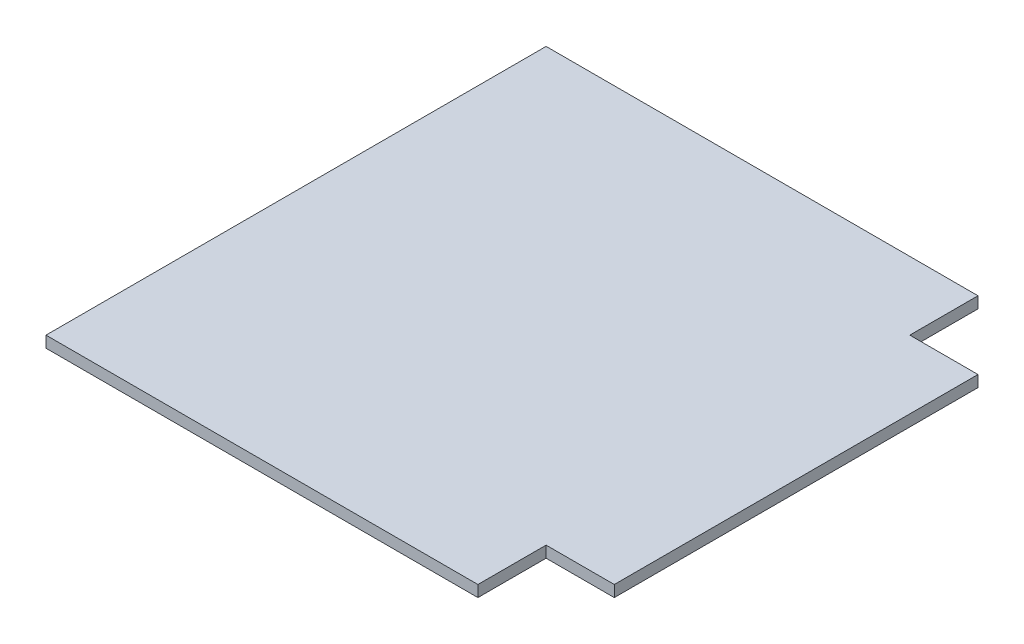
ISO-10303-21;
HEADER;
FILE_DESCRIPTION(('STEP AP214'),'2;1');
FILE_NAME('part.step','',(''),(''),'','','');
FILE_SCHEMA(('AUTOMOTIVE_DESIGN { 1 0 10303 214 1 1 1 1 }'));
ENDSEC;
DATA;
#1=APPLICATION_CONTEXT('core data for automotive mechanical design processes');
#2=APPLICATION_PROTOCOL_DEFINITION('international standard','automotive_design',2000,#1);
#3=PRODUCT_CONTEXT('',#1,'mechanical');
#4=PRODUCT('Part','Part','',(#3));
#5=PRODUCT_RELATED_PRODUCT_CATEGORY('part','',(#4));
#6=PRODUCT_DEFINITION_FORMATION('','',#4);
#7=PRODUCT_DEFINITION_CONTEXT('part definition',#1,'design');
#8=PRODUCT_DEFINITION('design','',#6,#7);
#9=PRODUCT_DEFINITION_SHAPE('','',#8);
#10=(LENGTH_UNIT() NAMED_UNIT(*) SI_UNIT(.MILLI.,.METRE.));
#11=(NAMED_UNIT(*) PLANE_ANGLE_UNIT() SI_UNIT($,.RADIAN.));
#12=(NAMED_UNIT(*) SI_UNIT($,.STERADIAN.) SOLID_ANGLE_UNIT());
#13=UNCERTAINTY_MEASURE_WITH_UNIT(LENGTH_MEASURE(1.E-05),#10,'distance_accuracy_value','');
#14=(GEOMETRIC_REPRESENTATION_CONTEXT(3) GLOBAL_UNCERTAINTY_ASSIGNED_CONTEXT((#13)) GLOBAL_UNIT_ASSIGNED_CONTEXT((#10,
#11,#12)) REPRESENTATION_CONTEXT('',''));
#15=CARTESIAN_POINT('',(0.,0.,0.));
#16=DIRECTION('',(0.,0.,1.));
#17=DIRECTION('',(1.,0.,0.));
#18=AXIS2_PLACEMENT_3D('',#15,#16,#17);
#19=CARTESIAN_POINT('',(-139.7,6.35,139.7));
#20=DIRECTION('',(1.,0.,0.));
#21=DIRECTION('',(0.,0.,-1.));
#22=AXIS2_PLACEMENT_3D('',#19,#20,#21);
#23=PLANE('',#22);
#24=DIRECTION('',(0.,0.,1.));
#25=VECTOR('',#24,1.);
#26=CARTESIAN_POINT('',(-139.7,0.,139.7));
#27=LINE('',#26,#25);
#28=CARTESIAN_POINT('',(-139.7,0.,-139.7));
#29=VERTEX_POINT('',#28);
#30=CARTESIAN_POINT('',(-139.7,0.,139.7));
#31=VERTEX_POINT('',#30);
#32=EDGE_CURVE('E125',#29,#31,#27,.T.);
#33=ORIENTED_EDGE('',*,*,#32,.T.);
#34=DIRECTION('',(0.,-1.,0.));
#35=VECTOR('',#34,1.);
#36=CARTESIAN_POINT('',(-139.7,6.35,139.7));
#37=LINE('',#36,#35);
#38=CARTESIAN_POINT('',(-139.7,6.35,139.7));
#39=VERTEX_POINT('',#38);
#40=EDGE_CURVE('E11',#39,#31,#37,.T.);
#41=ORIENTED_EDGE('',*,*,#40,.F.);
#42=DIRECTION('',(0.,0.,1.));
#43=VECTOR('',#42,1.);
#44=CARTESIAN_POINT('',(-139.7,6.35,139.7));
#45=LINE('',#44,#43);
#46=CARTESIAN_POINT('',(-139.7,6.35,-139.7));
#47=VERTEX_POINT('',#46);
#48=EDGE_CURVE('E122',#47,#39,#45,.T.);
#49=ORIENTED_EDGE('',*,*,#48,.F.);
#50=DIRECTION('',(0.,-1.,0.));
#51=VECTOR('',#50,1.);
#52=CARTESIAN_POINT('',(-139.7,6.35,-139.7));
#53=LINE('',#52,#51);
#54=EDGE_CURVE('E41',#47,#29,#53,.T.);
#55=ORIENTED_EDGE('',*,*,#54,.T.);
#56=EDGE_LOOP('',(#33,#41,#49,#55));
#57=FACE_BOUND('',#56,.T.);
#58=ADVANCED_FACE('F34',(#57),#23,.F.);
#59=CARTESIAN_POINT('',(139.7,6.35,139.7));
#60=DIRECTION('',(0.,0.,-1.));
#61=DIRECTION('',(-1.,0.,0.));
#62=AXIS2_PLACEMENT_3D('',#59,#60,#61);
#63=PLANE('',#62);
#64=DIRECTION('',(1.,0.,0.));
#65=VECTOR('',#64,1.);
#66=CARTESIAN_POINT('',(139.7,0.,139.7));
#67=LINE('',#66,#65);
#68=CARTESIAN_POINT('',(101.6,0.,139.7));
#69=VERTEX_POINT('',#68);
#70=EDGE_CURVE('E120',#31,#69,#67,.T.);
#71=ORIENTED_EDGE('',*,*,#70,.T.);
#72=DIRECTION('',(0.,1.,0.));
#73=VECTOR('',#72,1.);
#74=CARTESIAN_POINT('',(101.6,0.,139.7));
#75=LINE('',#74,#73);
#76=CARTESIAN_POINT('',(101.6,6.35,139.7));
#77=VERTEX_POINT('',#76);
#78=EDGE_CURVE('E143',#69,#77,#75,.T.);
#79=ORIENTED_EDGE('',*,*,#78,.T.);
#80=DIRECTION('',(1.,0.,0.));
#81=VECTOR('',#80,1.);
#82=CARTESIAN_POINT('',(139.7,6.35,139.7));
#83=LINE('',#82,#81);
#84=EDGE_CURVE('E140',#39,#77,#83,.T.);
#85=ORIENTED_EDGE('',*,*,#84,.F.);
#86=ORIENTED_EDGE('',*,*,#40,.T.);
#87=EDGE_LOOP('',(#71,#79,#85,#86));
#88=FACE_BOUND('',#87,.T.);
#89=ADVANCED_FACE('F170',(#88),#63,.F.);
#90=CARTESIAN_POINT('',(139.7,6.35,139.7));
#91=DIRECTION('',(-1.,0.,0.));
#92=DIRECTION('',(0.,0.,1.));
#93=AXIS2_PLACEMENT_3D('',#90,#91,#92);
#94=PLANE('',#93);
#95=DIRECTION('',(0.,0.,-1.));
#96=VECTOR('',#95,1.);
#97=CARTESIAN_POINT('',(139.7,6.35,139.7));
#98=LINE('',#97,#96);
#99=CARTESIAN_POINT('',(139.7,6.35,101.6));
#100=VERTEX_POINT('',#99);
#101=CARTESIAN_POINT('',(139.7,6.35,-101.6));
#102=VERTEX_POINT('',#101);
#103=EDGE_CURVE('E115',#100,#102,#98,.T.);
#104=ORIENTED_EDGE('',*,*,#103,.F.);
#105=DIRECTION('',(0.,1.,0.));
#106=VECTOR('',#105,1.);
#107=CARTESIAN_POINT('',(139.7,0.,101.6));
#108=LINE('',#107,#106);
#109=CARTESIAN_POINT('',(139.7,0.,101.6));
#110=VERTEX_POINT('',#109);
#111=EDGE_CURVE('E101',#110,#100,#108,.T.);
#112=ORIENTED_EDGE('',*,*,#111,.F.);
#113=DIRECTION('',(0.,0.,-1.));
#114=VECTOR('',#113,1.);
#115=CARTESIAN_POINT('',(139.7,0.,139.7));
#116=LINE('',#115,#114);
#117=CARTESIAN_POINT('',(139.7,0.,-101.6));
#118=VERTEX_POINT('',#117);
#119=EDGE_CURVE('E113',#110,#118,#116,.T.);
#120=ORIENTED_EDGE('',*,*,#119,.T.);
#121=DIRECTION('',(0.,1.,0.));
#122=VECTOR('',#121,1.);
#123=CARTESIAN_POINT('',(139.7,0.,-101.6));
#124=LINE('',#123,#122);
#125=EDGE_CURVE('E162',#118,#102,#124,.T.);
#126=ORIENTED_EDGE('',*,*,#125,.T.);
#127=EDGE_LOOP('',(#104,#112,#120,#126));
#128=FACE_BOUND('',#127,.T.);
#129=ADVANCED_FACE('F111',(#128),#94,.F.);
#130=CARTESIAN_POINT('',(139.7,6.35,-139.7));
#131=DIRECTION('',(0.,0.,1.));
#132=DIRECTION('',(1.,0.,0.));
#133=AXIS2_PLACEMENT_3D('',#130,#131,#132);
#134=PLANE('',#133);
#135=DIRECTION('',(-1.,0.,0.));
#136=VECTOR('',#135,1.);
#137=CARTESIAN_POINT('',(139.7,6.35,-139.7));
#138=LINE('',#137,#136);
#139=CARTESIAN_POINT('',(101.6,6.35,-139.7));
#140=VERTEX_POINT('',#139);
#141=EDGE_CURVE('E129',#140,#47,#138,.T.);
#142=ORIENTED_EDGE('',*,*,#141,.F.);
#143=DIRECTION('',(0.,1.,0.));
#144=VECTOR('',#143,1.);
#145=CARTESIAN_POINT('',(101.6,0.,-139.7));
#146=LINE('',#145,#144);
#147=CARTESIAN_POINT('',(101.6,0.,-139.7));
#148=VERTEX_POINT('',#147);
#149=EDGE_CURVE('E157',#148,#140,#146,.T.);
#150=ORIENTED_EDGE('',*,*,#149,.F.);
#151=DIRECTION('',(-1.,0.,0.));
#152=VECTOR('',#151,1.);
#153=CARTESIAN_POINT('',(139.7,0.,-139.7));
#154=LINE('',#153,#152);
#155=EDGE_CURVE('E119',#148,#29,#154,.T.);
#156=ORIENTED_EDGE('',*,*,#155,.T.);
#157=ORIENTED_EDGE('',*,*,#54,.F.);
#158=EDGE_LOOP('',(#142,#150,#156,#157));
#159=FACE_BOUND('',#158,.T.);
#160=ADVANCED_FACE('F178',(#159),#134,.F.);
#161=CARTESIAN_POINT('',(0.,6.35,0.));
#162=DIRECTION('',(0.,1.,0.));
#163=DIRECTION('',(0.,0.,1.));
#164=AXIS2_PLACEMENT_3D('',#161,#162,#163);
#165=PLANE('',#164);
#166=DIRECTION('',(0.,0.,1.));
#167=VECTOR('',#166,1.);
#168=CARTESIAN_POINT('',(101.6,6.35,139.7));
#169=LINE('',#168,#167);
#170=CARTESIAN_POINT('',(101.6,6.35,101.6));
#171=VERTEX_POINT('',#170);
#172=EDGE_CURVE('E106',#171,#77,#169,.T.);
#173=ORIENTED_EDGE('',*,*,#172,.F.);
#174=DIRECTION('',(-1.,0.,0.));
#175=VECTOR('',#174,1.);
#176=CARTESIAN_POINT('',(139.7,6.35,101.6));
#177=LINE('',#176,#175);
#178=EDGE_CURVE('E164',#100,#171,#177,.T.);
#179=ORIENTED_EDGE('',*,*,#178,.F.);
#180=ORIENTED_EDGE('',*,*,#103,.T.);
#181=DIRECTION('',(1.,0.,0.));
#182=VECTOR('',#181,1.);
#183=CARTESIAN_POINT('',(139.7,6.35,-101.6));
#184=LINE('',#183,#182);
#185=CARTESIAN_POINT('',(101.6,6.35,-101.6));
#186=VERTEX_POINT('',#185);
#187=EDGE_CURVE('E155',#186,#102,#184,.T.);
#188=ORIENTED_EDGE('',*,*,#187,.F.);
#189=DIRECTION('',(0.,0.,1.));
#190=VECTOR('',#189,1.);
#191=CARTESIAN_POINT('',(101.6,6.35,-139.7));
#192=LINE('',#191,#190);
#193=EDGE_CURVE('E158',#140,#186,#192,.T.);
#194=ORIENTED_EDGE('',*,*,#193,.F.);
#195=ORIENTED_EDGE('',*,*,#141,.T.);
#196=ORIENTED_EDGE('',*,*,#48,.T.);
#197=ORIENTED_EDGE('',*,*,#84,.T.);
#198=EDGE_LOOP('',(#173,#179,#180,#188,#194,#195,#196,#197));
#199=FACE_BOUND('',#198,.T.);
#200=ADVANCED_FACE('F169',(#199),#165,.T.);
#201=CARTESIAN_POINT('',(0.,0.,0.));
#202=DIRECTION('',(0.,1.,0.));
#203=DIRECTION('',(0.,0.,1.));
#204=AXIS2_PLACEMENT_3D('',#201,#202,#203);
#205=PLANE('',#204);
#206=DIRECTION('',(-1.,0.,0.));
#207=VECTOR('',#206,1.);
#208=CARTESIAN_POINT('',(139.7,0.,101.6));
#209=LINE('',#208,#207);
#210=CARTESIAN_POINT('',(101.6,0.,101.6));
#211=VERTEX_POINT('',#210);
#212=EDGE_CURVE('E97',#110,#211,#209,.T.);
#213=ORIENTED_EDGE('',*,*,#212,.T.);
#214=DIRECTION('',(0.,0.,1.));
#215=VECTOR('',#214,1.);
#216=CARTESIAN_POINT('',(101.6,0.,139.7));
#217=LINE('',#216,#215);
#218=EDGE_CURVE('E48',#211,#69,#217,.T.);
#219=ORIENTED_EDGE('',*,*,#218,.T.);
#220=ORIENTED_EDGE('',*,*,#70,.F.);
#221=ORIENTED_EDGE('',*,*,#32,.F.);
#222=ORIENTED_EDGE('',*,*,#155,.F.);
#223=DIRECTION('',(0.,0.,1.));
#224=VECTOR('',#223,1.);
#225=CARTESIAN_POINT('',(101.6,0.,-139.7));
#226=LINE('',#225,#224);
#227=CARTESIAN_POINT('',(101.6,0.,-101.6));
#228=VERTEX_POINT('',#227);
#229=EDGE_CURVE('E153',#148,#228,#226,.T.);
#230=ORIENTED_EDGE('',*,*,#229,.T.);
#231=DIRECTION('',(1.,0.,0.));
#232=VECTOR('',#231,1.);
#233=CARTESIAN_POINT('',(139.7,0.,-101.6));
#234=LINE('',#233,#232);
#235=EDGE_CURVE('E56',#228,#118,#234,.T.);
#236=ORIENTED_EDGE('',*,*,#235,.T.);
#237=ORIENTED_EDGE('',*,*,#119,.F.);
#238=EDGE_LOOP('',(#213,#219,#220,#221,#222,#230,#236,#237));
#239=FACE_BOUND('',#238,.T.);
#240=ADVANCED_FACE('F117',(#239),#205,.F.);
#241=CARTESIAN_POINT('',(139.7,0.,-101.6));
#242=DIRECTION('',(0.,0.,1.));
#243=DIRECTION('',(1.,0.,0.));
#244=AXIS2_PLACEMENT_3D('',#241,#242,#243);
#245=PLANE('',#244);
#246=ORIENTED_EDGE('',*,*,#187,.T.);
#247=ORIENTED_EDGE('',*,*,#125,.F.);
#248=ORIENTED_EDGE('',*,*,#235,.F.);
#249=DIRECTION('',(0.,1.,0.));
#250=VECTOR('',#249,1.);
#251=CARTESIAN_POINT('',(101.6,0.,-101.6));
#252=LINE('',#251,#250);
#253=EDGE_CURVE('E165',#228,#186,#252,.T.);
#254=ORIENTED_EDGE('',*,*,#253,.T.);
#255=EDGE_LOOP('',(#246,#247,#248,#254));
#256=FACE_BOUND('',#255,.T.);
#257=ADVANCED_FACE('F186',(#256),#245,.F.);
#258=CARTESIAN_POINT('',(101.6,0.,-139.7));
#259=DIRECTION('',(-1.,0.,0.));
#260=DIRECTION('',(0.,0.,1.));
#261=AXIS2_PLACEMENT_3D('',#258,#259,#260);
#262=PLANE('',#261);
#263=ORIENTED_EDGE('',*,*,#193,.T.);
#264=ORIENTED_EDGE('',*,*,#253,.F.);
#265=ORIENTED_EDGE('',*,*,#229,.F.);
#266=ORIENTED_EDGE('',*,*,#149,.T.);
#267=EDGE_LOOP('',(#263,#264,#265,#266));
#268=FACE_BOUND('',#267,.T.);
#269=ADVANCED_FACE('F189',(#268),#262,.F.);
#270=CARTESIAN_POINT('',(101.6,0.,139.7));
#271=DIRECTION('',(-1.,0.,0.));
#272=DIRECTION('',(0.,0.,1.));
#273=AXIS2_PLACEMENT_3D('',#270,#271,#272);
#274=PLANE('',#273);
#275=ORIENTED_EDGE('',*,*,#172,.T.);
#276=ORIENTED_EDGE('',*,*,#78,.F.);
#277=ORIENTED_EDGE('',*,*,#218,.F.);
#278=DIRECTION('',(0.,1.,0.));
#279=VECTOR('',#278,1.);
#280=CARTESIAN_POINT('',(101.6,0.,101.6));
#281=LINE('',#280,#279);
#282=EDGE_CURVE('E103',#211,#171,#281,.T.);
#283=ORIENTED_EDGE('',*,*,#282,.T.);
#284=EDGE_LOOP('',(#275,#276,#277,#283));
#285=FACE_BOUND('',#284,.T.);
#286=ADVANCED_FACE('F192',(#285),#274,.F.);
#287=CARTESIAN_POINT('',(139.7,0.,101.6));
#288=DIRECTION('',(0.,0.,-1.));
#289=DIRECTION('',(-1.,0.,0.));
#290=AXIS2_PLACEMENT_3D('',#287,#288,#289);
#291=PLANE('',#290);
#292=ORIENTED_EDGE('',*,*,#178,.T.);
#293=ORIENTED_EDGE('',*,*,#282,.F.);
#294=ORIENTED_EDGE('',*,*,#212,.F.);
#295=ORIENTED_EDGE('',*,*,#111,.T.);
#296=EDGE_LOOP('',(#292,#293,#294,#295));
#297=FACE_BOUND('',#296,.T.);
#298=ADVANCED_FACE('F100',(#297),#291,.F.);
#299=CLOSED_SHELL('',(#58,#89,#129,#160,#200,#240,#257,#269,#286,#298));
#300=MANIFOLD_SOLID_BREP('B2',#299);
#301=ADVANCED_BREP_SHAPE_REPRESENTATION('',(#18,#300),#14);
#302=SHAPE_DEFINITION_REPRESENTATION(#9,#301);
ENDSEC;
END-ISO-10303-21;
